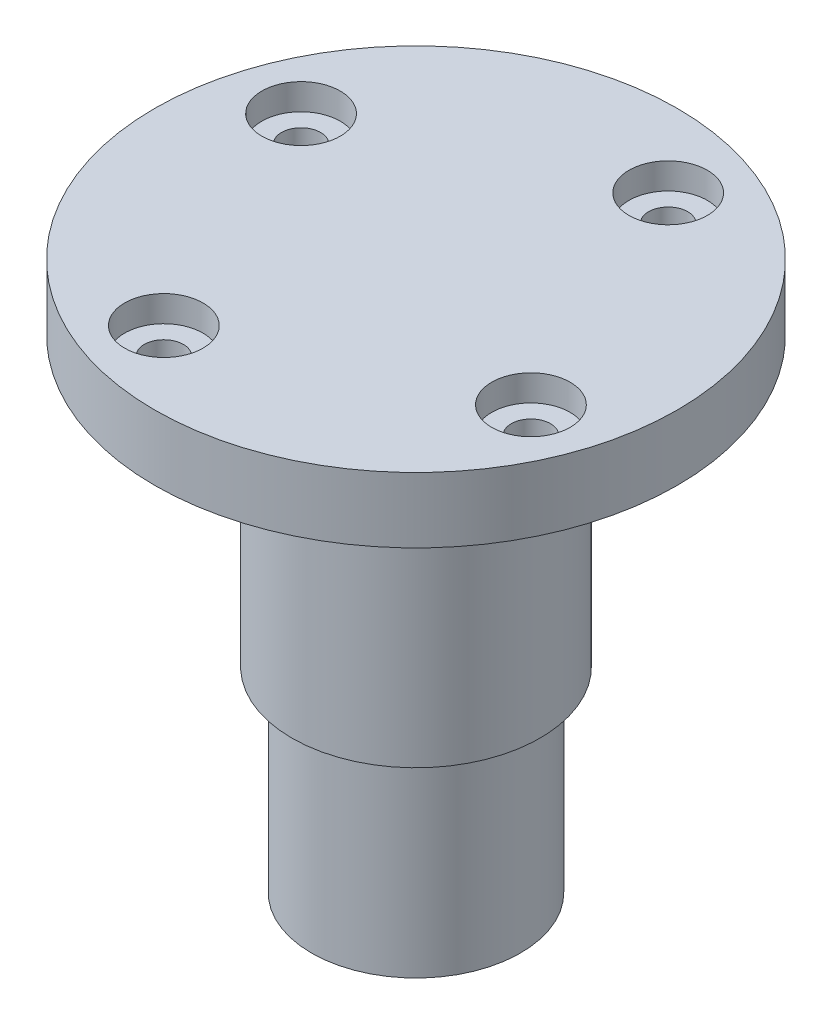
ISO-10303-21;
HEADER;
FILE_DESCRIPTION(('STEP AP214'),'2;1');
FILE_NAME('part.step','',(''),(''),'','','');
FILE_SCHEMA(('AUTOMOTIVE_DESIGN { 1 0 10303 214 1 1 1 1 }'));
ENDSEC;
DATA;
#1=APPLICATION_CONTEXT('core data for automotive mechanical design processes');
#2=APPLICATION_PROTOCOL_DEFINITION('international standard','automotive_design',2000,#1);
#3=PRODUCT_CONTEXT('',#1,'mechanical');
#4=PRODUCT('Part','Part','',(#3));
#5=PRODUCT_RELATED_PRODUCT_CATEGORY('part','',(#4));
#6=PRODUCT_DEFINITION_FORMATION('','',#4);
#7=PRODUCT_DEFINITION_CONTEXT('part definition',#1,'design');
#8=PRODUCT_DEFINITION('design','',#6,#7);
#9=PRODUCT_DEFINITION_SHAPE('','',#8);
#10=(LENGTH_UNIT() NAMED_UNIT(*) SI_UNIT(.MILLI.,.METRE.));
#11=(NAMED_UNIT(*) PLANE_ANGLE_UNIT() SI_UNIT($,.RADIAN.));
#12=(NAMED_UNIT(*) SI_UNIT($,.STERADIAN.) SOLID_ANGLE_UNIT());
#13=UNCERTAINTY_MEASURE_WITH_UNIT(LENGTH_MEASURE(1.E-05),#10,'distance_accuracy_value','');
#14=(GEOMETRIC_REPRESENTATION_CONTEXT(3) GLOBAL_UNCERTAINTY_ASSIGNED_CONTEXT((#13)) GLOBAL_UNIT_ASSIGNED_CONTEXT((#10,
#11,#12)) REPRESENTATION_CONTEXT('',''));
#15=CARTESIAN_POINT('',(0.,0.,0.));
#16=DIRECTION('',(0.,0.,1.));
#17=DIRECTION('',(1.,0.,0.));
#18=AXIS2_PLACEMENT_3D('',#15,#16,#17);
#19=CARTESIAN_POINT('',(-5.25234610227419,37.,14.0503686934516));
#20=DIRECTION('',(0.,1.,0.));
#21=DIRECTION('',(0.,0.,1.));
#22=AXIS2_PLACEMENT_3D('',#19,#20,#21);
#23=CYLINDRICAL_SURFACE('',#22,1.50000000000075);
#24=CARTESIAN_POINT('',(-5.25234610227419,37.,14.0503686934516));
#25=DIRECTION('',(0.,1.,0.));
#26=DIRECTION('',(0.,0.,1.));
#27=AXIS2_PLACEMENT_3D('',#24,#25,#26);
#28=CIRCLE('',#27,1.50000000000075);
#29=CARTESIAN_POINT('',(-5.25234610227419,37.,15.5503686934524));
#30=VERTEX_POINT('',#29);
#31=EDGE_CURVE('E71',#30,#30,#28,.T.);
#32=ORIENTED_EDGE('',*,*,#31,.F.);
#33=EDGE_LOOP('',(#32));
#34=FACE_BOUND('',#33,.T.);
#35=CARTESIAN_POINT('',(-5.25234610227419,40.,14.0503686934516));
#36=DIRECTION('',(0.,1.,0.));
#37=DIRECTION('',(0.,0.,1.));
#38=AXIS2_PLACEMENT_3D('',#35,#36,#37);
#39=CIRCLE('',#38,1.50000000000075);
#40=CARTESIAN_POINT('',(-5.25234610227419,40.,15.5503686934524));
#41=VERTEX_POINT('',#40);
#42=EDGE_CURVE('E41',#41,#41,#39,.F.);
#43=ORIENTED_EDGE('',*,*,#42,.F.);
#44=EDGE_LOOP('',(#43));
#45=FACE_BOUND('',#44,.T.);
#46=ADVANCED_FACE('F37',(#34,#45),#23,.F.);
#47=CARTESIAN_POINT('',(14.0503686934519,37.,5.25234610227474));
#48=DIRECTION('',(0.,1.,0.));
#49=DIRECTION('',(0.,0.,1.));
#50=AXIS2_PLACEMENT_3D('',#47,#48,#49);
#51=CYLINDRICAL_SURFACE('',#50,1.50000000000011);
#52=CARTESIAN_POINT('',(14.0503686934519,37.,5.25234610227474));
#53=DIRECTION('',(0.,1.,0.));
#54=DIRECTION('',(0.,0.,1.));
#55=AXIS2_PLACEMENT_3D('',#52,#53,#54);
#56=CIRCLE('',#55,1.50000000000011);
#57=CARTESIAN_POINT('',(14.0503686934519,37.,6.75234610227485));
#58=VERTEX_POINT('',#57);
#59=EDGE_CURVE('E76',#58,#58,#56,.T.);
#60=ORIENTED_EDGE('',*,*,#59,.F.);
#61=EDGE_LOOP('',(#60));
#62=FACE_BOUND('',#61,.T.);
#63=CARTESIAN_POINT('',(14.0503686934519,40.,5.25234610227474));
#64=DIRECTION('',(0.,1.,0.));
#65=DIRECTION('',(0.,0.,1.));
#66=AXIS2_PLACEMENT_3D('',#63,#64,#65);
#67=CIRCLE('',#66,1.50000000000011);
#68=CARTESIAN_POINT('',(14.0503686934519,40.,6.75234610227485));
#69=VERTEX_POINT('',#68);
#70=EDGE_CURVE('E64',#69,#69,#67,.F.);
#71=ORIENTED_EDGE('',*,*,#70,.F.);
#72=EDGE_LOOP('',(#71));
#73=FACE_BOUND('',#72,.T.);
#74=ADVANCED_FACE('F119',(#62,#73),#51,.F.);
#75=CARTESIAN_POINT('',(5.25234610227497,37.,-14.0503686934513));
#76=DIRECTION('',(0.,1.,0.));
#77=DIRECTION('',(0.,0.,1.));
#78=AXIS2_PLACEMENT_3D('',#75,#76,#77);
#79=CYLINDRICAL_SURFACE('',#78,1.5);
#80=CARTESIAN_POINT('',(5.25234610227497,37.,-14.0503686934513));
#81=DIRECTION('',(0.,1.,0.));
#82=DIRECTION('',(0.,0.,1.));
#83=AXIS2_PLACEMENT_3D('',#80,#81,#82);
#84=CIRCLE('',#83,1.5);
#85=CARTESIAN_POINT('',(5.25234610227497,37.,-12.5503686934513));
#86=VERTEX_POINT('',#85);
#87=EDGE_CURVE('E82',#86,#86,#84,.T.);
#88=ORIENTED_EDGE('',*,*,#87,.F.);
#89=EDGE_LOOP('',(#88));
#90=FACE_BOUND('',#89,.T.);
#91=CARTESIAN_POINT('',(5.25234610227497,40.,-14.0503686934513));
#92=DIRECTION('',(0.,1.,0.));
#93=DIRECTION('',(0.,0.,1.));
#94=AXIS2_PLACEMENT_3D('',#91,#92,#93);
#95=CIRCLE('',#94,1.5);
#96=CARTESIAN_POINT('',(5.25234610227497,40.,-12.5503686934513));
#97=VERTEX_POINT('',#96);
#98=EDGE_CURVE('E60',#97,#97,#95,.F.);
#99=ORIENTED_EDGE('',*,*,#98,.F.);
#100=EDGE_LOOP('',(#99));
#101=FACE_BOUND('',#100,.T.);
#102=ADVANCED_FACE('F125',(#90,#101),#79,.F.);
#103=CARTESIAN_POINT('',(-14.0503686934511,37.,-5.25234610227444));
#104=DIRECTION('',(0.,1.,0.));
#105=DIRECTION('',(0.,0.,1.));
#106=AXIS2_PLACEMENT_3D('',#103,#104,#105);
#107=CYLINDRICAL_SURFACE('',#106,1.50000000000071);
#108=CARTESIAN_POINT('',(-14.0503686934511,37.,-5.25234610227444));
#109=DIRECTION('',(0.,1.,0.));
#110=DIRECTION('',(0.,0.,1.));
#111=AXIS2_PLACEMENT_3D('',#108,#109,#110);
#112=CIRCLE('',#111,1.50000000000071);
#113=CARTESIAN_POINT('',(-14.0503686934511,37.,-3.75234610227372));
#114=VERTEX_POINT('',#113);
#115=EDGE_CURVE('E95',#114,#114,#112,.T.);
#116=ORIENTED_EDGE('',*,*,#115,.F.);
#117=EDGE_LOOP('',(#116));
#118=FACE_BOUND('',#117,.T.);
#119=CARTESIAN_POINT('',(-14.0503686934511,40.,-5.25234610227444));
#120=DIRECTION('',(0.,1.,0.));
#121=DIRECTION('',(0.,0.,1.));
#122=AXIS2_PLACEMENT_3D('',#119,#120,#121);
#123=CIRCLE('',#122,1.50000000000071);
#124=CARTESIAN_POINT('',(-14.0503686934511,40.,-3.75234610227372));
#125=VERTEX_POINT('',#124);
#126=EDGE_CURVE('E56',#125,#125,#123,.F.);
#127=ORIENTED_EDGE('',*,*,#126,.F.);
#128=EDGE_LOOP('',(#127));
#129=FACE_BOUND('',#128,.T.);
#130=ADVANCED_FACE('F254',(#118,#129),#107,.F.);
#131=CARTESIAN_POINT('',(0.,37.,0.));
#132=DIRECTION('',(0.,-1.,0.));
#133=DIRECTION('',(0.,0.,-1.));
#134=AXIS2_PLACEMENT_3D('',#131,#132,#133);
#135=CYLINDRICAL_SURFACE('',#134,8.);
#136=CARTESIAN_POINT('',(0.,0.,0.));
#137=DIRECTION('',(0.,1.,0.));
#138=DIRECTION('',(0.,0.,1.));
#139=AXIS2_PLACEMENT_3D('',#136,#137,#138);
#140=CIRCLE('',#139,8.);
#141=CARTESIAN_POINT('',(0.,0.,8.));
#142=VERTEX_POINT('',#141);
#143=EDGE_CURVE('E46',#142,#142,#140,.T.);
#144=ORIENTED_EDGE('',*,*,#143,.T.);
#145=EDGE_LOOP('',(#144));
#146=FACE_BOUND('',#145,.T.);
#147=CARTESIAN_POINT('',(0.,15.,0.));
#148=DIRECTION('',(0.,1.,0.));
#149=DIRECTION('',(0.,0.,1.));
#150=AXIS2_PLACEMENT_3D('',#147,#148,#149);
#151=CIRCLE('',#150,8.);
#152=CARTESIAN_POINT('',(0.,15.,8.));
#153=VERTEX_POINT('',#152);
#154=EDGE_CURVE('E10',#153,#153,#151,.T.);
#155=ORIENTED_EDGE('',*,*,#154,.F.);
#156=EDGE_LOOP('',(#155));
#157=FACE_BOUND('',#156,.T.);
#158=ADVANCED_FACE('F39',(#146,#157),#135,.T.);
#159=CARTESIAN_POINT('',(0.,0.,0.));
#160=DIRECTION('',(0.,1.,0.));
#161=DIRECTION('',(0.,0.,1.));
#162=AXIS2_PLACEMENT_3D('',#159,#160,#161);
#163=PLANE('',#162);
#164=ORIENTED_EDGE('',*,*,#143,.F.);
#165=EDGE_LOOP('',(#164));
#166=FACE_BOUND('',#165,.T.);
#167=ADVANCED_FACE('F108',(#166),#163,.F.);
#168=CARTESIAN_POINT('',(0.,15.,0.));
#169=DIRECTION('',(0.,1.,0.));
#170=DIRECTION('',(0.,0.,1.));
#171=AXIS2_PLACEMENT_3D('',#168,#169,#170);
#172=CYLINDRICAL_SURFACE('',#171,9.5);
#173=CARTESIAN_POINT('',(0.,15.,0.));
#174=DIRECTION('',(0.,1.,0.));
#175=DIRECTION('',(0.,0.,1.));
#176=AXIS2_PLACEMENT_3D('',#173,#174,#175);
#177=CIRCLE('',#176,9.5);
#178=CARTESIAN_POINT('',(0.,15.,9.5));
#179=VERTEX_POINT('',#178);
#180=EDGE_CURVE('E52',#179,#179,#177,.T.);
#181=ORIENTED_EDGE('',*,*,#180,.T.);
#182=EDGE_LOOP('',(#181));
#183=FACE_BOUND('',#182,.T.);
#184=CARTESIAN_POINT('',(0.,37.,0.));
#185=DIRECTION('',(0.,1.,0.));
#186=DIRECTION('',(0.,0.,1.));
#187=AXIS2_PLACEMENT_3D('',#184,#185,#186);
#188=CIRCLE('',#187,9.5);
#189=CARTESIAN_POINT('',(0.,37.,9.5));
#190=VERTEX_POINT('',#189);
#191=EDGE_CURVE('E90',#190,#190,#188,.T.);
#192=ORIENTED_EDGE('',*,*,#191,.F.);
#193=EDGE_LOOP('',(#192));
#194=FACE_BOUND('',#193,.T.);
#195=ADVANCED_FACE('F105',(#183,#194),#172,.T.);
#196=CARTESIAN_POINT('',(0.,15.,0.));
#197=DIRECTION('',(0.,1.,0.));
#198=DIRECTION('',(0.,0.,1.));
#199=AXIS2_PLACEMENT_3D('',#196,#197,#198);
#200=PLANE('',#199);
#201=ORIENTED_EDGE('',*,*,#154,.T.);
#202=EDGE_LOOP('',(#201));
#203=FACE_BOUND('',#202,.T.);
#204=ORIENTED_EDGE('',*,*,#180,.F.);
#205=EDGE_LOOP('',(#204));
#206=FACE_BOUND('',#205,.T.);
#207=ADVANCED_FACE('F107',(#203,#206),#200,.F.);
#208=CARTESIAN_POINT('',(0.,42.,0.));
#209=DIRECTION('',(0.,-1.,0.));
#210=DIRECTION('',(0.,0.,-1.));
#211=AXIS2_PLACEMENT_3D('',#208,#209,#210);
#212=CYLINDRICAL_SURFACE('',#211,20.);
#213=CARTESIAN_POINT('',(0.,42.,0.));
#214=DIRECTION('',(0.,1.,0.));
#215=DIRECTION('',(0.,0.,1.));
#216=AXIS2_PLACEMENT_3D('',#213,#214,#215);
#217=CIRCLE('',#216,20.);
#218=CARTESIAN_POINT('',(0.,42.,20.));
#219=VERTEX_POINT('',#218);
#220=EDGE_CURVE('E86',#219,#219,#217,.T.);
#221=ORIENTED_EDGE('',*,*,#220,.F.);
#222=EDGE_LOOP('',(#221));
#223=FACE_BOUND('',#222,.T.);
#224=CARTESIAN_POINT('',(0.,37.,0.));
#225=DIRECTION('',(0.,1.,0.));
#226=DIRECTION('',(0.,0.,1.));
#227=AXIS2_PLACEMENT_3D('',#224,#225,#226);
#228=CIRCLE('',#227,20.);
#229=CARTESIAN_POINT('',(0.,37.,20.));
#230=VERTEX_POINT('',#229);
#231=EDGE_CURVE('E91',#230,#230,#228,.T.);
#232=ORIENTED_EDGE('',*,*,#231,.T.);
#233=EDGE_LOOP('',(#232));
#234=FACE_BOUND('',#233,.T.);
#235=ADVANCED_FACE('F115',(#223,#234),#212,.T.);
#236=CARTESIAN_POINT('',(0.,42.,0.));
#237=DIRECTION('',(0.,1.,0.));
#238=DIRECTION('',(0.,0.,1.));
#239=AXIS2_PLACEMENT_3D('',#236,#237,#238);
#240=PLANE('',#239);
#241=CARTESIAN_POINT('',(-14.0503686934511,42.,-5.25234610227444));
#242=DIRECTION('',(0.,1.,0.));
#243=DIRECTION('',(0.,0.,1.));
#244=AXIS2_PLACEMENT_3D('',#241,#242,#243);
#245=CIRCLE('',#244,3.);
#246=CARTESIAN_POINT('',(-14.0503686934511,42.,-2.25234610227443));
#247=VERTEX_POINT('',#246);
#248=EDGE_CURVE('E330',#247,#247,#245,.T.);
#249=ORIENTED_EDGE('',*,*,#248,.F.);
#250=EDGE_LOOP('',(#249));
#251=FACE_BOUND('',#250,.T.);
#252=CARTESIAN_POINT('',(5.25234610227418,42.,-14.0503686934516));
#253=DIRECTION('',(0.,1.,0.));
#254=DIRECTION('',(0.,0.,1.));
#255=AXIS2_PLACEMENT_3D('',#252,#253,#254);
#256=CIRCLE('',#255,3.00000000000064);
#257=CARTESIAN_POINT('',(5.25234610227418,42.,-11.050368693451));
#258=VERTEX_POINT('',#257);
#259=EDGE_CURVE('E322',#258,#258,#256,.T.);
#260=ORIENTED_EDGE('',*,*,#259,.F.);
#261=EDGE_LOOP('',(#260));
#262=FACE_BOUND('',#261,.T.);
#263=CARTESIAN_POINT('',(14.0503686934514,42.,5.25234610227363));
#264=DIRECTION('',(0.,1.,0.));
#265=DIRECTION('',(0.,0.,1.));
#266=AXIS2_PLACEMENT_3D('',#263,#264,#265);
#267=CIRCLE('',#266,3.00000000000059);
#268=CARTESIAN_POINT('',(14.0503686934514,42.,8.25234610227422));
#269=VERTEX_POINT('',#268);
#270=EDGE_CURVE('E314',#269,#269,#267,.T.);
#271=ORIENTED_EDGE('',*,*,#270,.F.);
#272=EDGE_LOOP('',(#271));
#273=FACE_BOUND('',#272,.T.);
#274=CARTESIAN_POINT('',(-5.25234610227388,42.,14.0503686934508));
#275=DIRECTION('',(0.,1.,0.));
#276=DIRECTION('',(0.,0.,1.));
#277=AXIS2_PLACEMENT_3D('',#274,#275,#276);
#278=CIRCLE('',#277,3.00000000000002);
#279=CARTESIAN_POINT('',(-5.25234610227388,42.,17.0503686934508));
#280=VERTEX_POINT('',#279);
#281=EDGE_CURVE('E306',#280,#280,#278,.T.);
#282=ORIENTED_EDGE('',*,*,#281,.F.);
#283=EDGE_LOOP('',(#282));
#284=FACE_BOUND('',#283,.T.);
#285=ORIENTED_EDGE('',*,*,#220,.T.);
#286=EDGE_LOOP('',(#285));
#287=FACE_BOUND('',#286,.T.);
#288=ADVANCED_FACE('F131',(#251,#262,#273,#284,#287),#240,.T.);
#289=CARTESIAN_POINT('',(0.,37.,0.));
#290=DIRECTION('',(0.,1.,0.));
#291=DIRECTION('',(0.,0.,1.));
#292=AXIS2_PLACEMENT_3D('',#289,#290,#291);
#293=PLANE('',#292);
#294=ORIENTED_EDGE('',*,*,#115,.T.);
#295=EDGE_LOOP('',(#294));
#296=FACE_BOUND('',#295,.T.);
#297=ORIENTED_EDGE('',*,*,#87,.T.);
#298=EDGE_LOOP('',(#297));
#299=FACE_BOUND('',#298,.T.);
#300=ORIENTED_EDGE('',*,*,#59,.T.);
#301=EDGE_LOOP('',(#300));
#302=FACE_BOUND('',#301,.T.);
#303=ORIENTED_EDGE('',*,*,#31,.T.);
#304=EDGE_LOOP('',(#303));
#305=FACE_BOUND('',#304,.T.);
#306=ORIENTED_EDGE('',*,*,#191,.T.);
#307=EDGE_LOOP('',(#306));
#308=FACE_BOUND('',#307,.T.);
#309=ORIENTED_EDGE('',*,*,#231,.F.);
#310=EDGE_LOOP('',(#309));
#311=FACE_BOUND('',#310,.T.);
#312=ADVANCED_FACE('F102',(#296,#299,#302,#305,#308,#311),#293,.F.);
#313=CARTESIAN_POINT('',(-14.0503686934511,40.,-5.25234610227444));
#314=DIRECTION('',(0.,1.,0.));
#315=DIRECTION('',(0.,0.,1.));
#316=AXIS2_PLACEMENT_3D('',#313,#314,#315);
#317=PLANE('',#316);
#318=CARTESIAN_POINT('',(-14.0503686934511,40.,-5.25234610227444));
#319=DIRECTION('',(0.,1.,0.));
#320=DIRECTION('',(0.,0.,1.));
#321=AXIS2_PLACEMENT_3D('',#318,#319,#320);
#322=CIRCLE('',#321,3.);
#323=CARTESIAN_POINT('',(-14.0503686934511,40.,-2.25234610227443));
#324=VERTEX_POINT('',#323);
#325=EDGE_CURVE('E61',#324,#324,#322,.T.);
#326=ORIENTED_EDGE('',*,*,#325,.T.);
#327=EDGE_LOOP('',(#326));
#328=FACE_BOUND('',#327,.T.);
#329=ORIENTED_EDGE('',*,*,#126,.T.);
#330=EDGE_LOOP('',(#329));
#331=FACE_BOUND('',#330,.T.);
#332=ADVANCED_FACE('F137',(#328,#331),#317,.T.);
#333=CARTESIAN_POINT('',(-14.0503686934511,40.,-5.25234610227444));
#334=DIRECTION('',(0.,1.,0.));
#335=DIRECTION('',(0.,0.,1.));
#336=AXIS2_PLACEMENT_3D('',#333,#334,#335);
#337=CYLINDRICAL_SURFACE('',#336,3.);
#338=ORIENTED_EDGE('',*,*,#325,.F.);
#339=EDGE_LOOP('',(#338));
#340=FACE_BOUND('',#339,.T.);
#341=ORIENTED_EDGE('',*,*,#248,.T.);
#342=EDGE_LOOP('',(#341));
#343=FACE_BOUND('',#342,.T.);
#344=ADVANCED_FACE('F164',(#340,#343),#337,.F.);
#345=CARTESIAN_POINT('',(5.25234610227418,40.,-14.0503686934516));
#346=DIRECTION('',(0.,1.,0.));
#347=DIRECTION('',(0.,0.,1.));
#348=AXIS2_PLACEMENT_3D('',#345,#346,#347);
#349=PLANE('',#348);
#350=CARTESIAN_POINT('',(5.25234610227418,40.,-14.0503686934516));
#351=DIRECTION('',(0.,1.,0.));
#352=DIRECTION('',(0.,0.,1.));
#353=AXIS2_PLACEMENT_3D('',#350,#351,#352);
#354=CIRCLE('',#353,3.00000000000064);
#355=CARTESIAN_POINT('',(5.25234610227418,40.,-11.050368693451));
#356=VERTEX_POINT('',#355);
#357=EDGE_CURVE('E326',#356,#356,#354,.T.);
#358=ORIENTED_EDGE('',*,*,#357,.T.);
#359=EDGE_LOOP('',(#358));
#360=FACE_BOUND('',#359,.T.);
#361=ORIENTED_EDGE('',*,*,#98,.T.);
#362=EDGE_LOOP('',(#361));
#363=FACE_BOUND('',#362,.T.);
#364=ADVANCED_FACE('F172',(#360,#363),#349,.T.);
#365=CARTESIAN_POINT('',(5.25234610227418,40.,-14.0503686934516));
#366=DIRECTION('',(0.,1.,0.));
#367=DIRECTION('',(0.,0.,1.));
#368=AXIS2_PLACEMENT_3D('',#365,#366,#367);
#369=CYLINDRICAL_SURFACE('',#368,3.00000000000064);
#370=ORIENTED_EDGE('',*,*,#357,.F.);
#371=EDGE_LOOP('',(#370));
#372=FACE_BOUND('',#371,.T.);
#373=ORIENTED_EDGE('',*,*,#259,.T.);
#374=EDGE_LOOP('',(#373));
#375=FACE_BOUND('',#374,.T.);
#376=ADVANCED_FACE('F180',(#372,#375),#369,.F.);
#377=CARTESIAN_POINT('',(14.0503686934514,40.,5.25234610227363));
#378=DIRECTION('',(0.,1.,0.));
#379=DIRECTION('',(0.,0.,1.));
#380=AXIS2_PLACEMENT_3D('',#377,#378,#379);
#381=PLANE('',#380);
#382=CARTESIAN_POINT('',(14.0503686934514,40.,5.25234610227363));
#383=DIRECTION('',(0.,1.,0.));
#384=DIRECTION('',(0.,0.,1.));
#385=AXIS2_PLACEMENT_3D('',#382,#383,#384);
#386=CIRCLE('',#385,3.00000000000059);
#387=CARTESIAN_POINT('',(14.0503686934514,40.,8.25234610227422));
#388=VERTEX_POINT('',#387);
#389=EDGE_CURVE('E318',#388,#388,#386,.T.);
#390=ORIENTED_EDGE('',*,*,#389,.T.);
#391=EDGE_LOOP('',(#390));
#392=FACE_BOUND('',#391,.T.);
#393=ORIENTED_EDGE('',*,*,#70,.T.);
#394=EDGE_LOOP('',(#393));
#395=FACE_BOUND('',#394,.T.);
#396=ADVANCED_FACE('F188',(#392,#395),#381,.T.);
#397=CARTESIAN_POINT('',(14.0503686934514,40.,5.25234610227363));
#398=DIRECTION('',(0.,1.,0.));
#399=DIRECTION('',(0.,0.,1.));
#400=AXIS2_PLACEMENT_3D('',#397,#398,#399);
#401=CYLINDRICAL_SURFACE('',#400,3.00000000000059);
#402=ORIENTED_EDGE('',*,*,#389,.F.);
#403=EDGE_LOOP('',(#402));
#404=FACE_BOUND('',#403,.T.);
#405=ORIENTED_EDGE('',*,*,#270,.T.);
#406=EDGE_LOOP('',(#405));
#407=FACE_BOUND('',#406,.T.);
#408=ADVANCED_FACE('F196',(#404,#407),#401,.F.);
#409=CARTESIAN_POINT('',(-5.25234610227388,40.,14.0503686934508));
#410=DIRECTION('',(0.,1.,0.));
#411=DIRECTION('',(0.,0.,1.));
#412=AXIS2_PLACEMENT_3D('',#409,#410,#411);
#413=PLANE('',#412);
#414=CARTESIAN_POINT('',(-5.25234610227388,40.,14.0503686934508));
#415=DIRECTION('',(0.,1.,0.));
#416=DIRECTION('',(0.,0.,1.));
#417=AXIS2_PLACEMENT_3D('',#414,#415,#416);
#418=CIRCLE('',#417,3.00000000000002);
#419=CARTESIAN_POINT('',(-5.25234610227388,40.,17.0503686934508));
#420=VERTEX_POINT('',#419);
#421=EDGE_CURVE('E310',#420,#420,#418,.T.);
#422=ORIENTED_EDGE('',*,*,#421,.T.);
#423=EDGE_LOOP('',(#422));
#424=FACE_BOUND('',#423,.T.);
#425=ORIENTED_EDGE('',*,*,#42,.T.);
#426=EDGE_LOOP('',(#425));
#427=FACE_BOUND('',#426,.T.);
#428=ADVANCED_FACE('F204',(#424,#427),#413,.T.);
#429=CARTESIAN_POINT('',(-5.25234610227388,40.,14.0503686934508));
#430=DIRECTION('',(0.,1.,0.));
#431=DIRECTION('',(0.,0.,1.));
#432=AXIS2_PLACEMENT_3D('',#429,#430,#431);
#433=CYLINDRICAL_SURFACE('',#432,3.00000000000002);
#434=ORIENTED_EDGE('',*,*,#421,.F.);
#435=EDGE_LOOP('',(#434));
#436=FACE_BOUND('',#435,.T.);
#437=ORIENTED_EDGE('',*,*,#281,.T.);
#438=EDGE_LOOP('',(#437));
#439=FACE_BOUND('',#438,.T.);
#440=ADVANCED_FACE('F212',(#436,#439),#433,.F.);
#441=CLOSED_SHELL('',(#46,#74,#102,#130,#158,#167,#195,#207,#235,#288,#312,#332,#344,#364,#376,
#396,#408,#428,#440));
#442=MANIFOLD_SOLID_BREP('B2',#441);
#443=ADVANCED_BREP_SHAPE_REPRESENTATION('',(#18,#442),#14);
#444=SHAPE_DEFINITION_REPRESENTATION(#9,#443);
ENDSEC;
END-ISO-10303-21;
